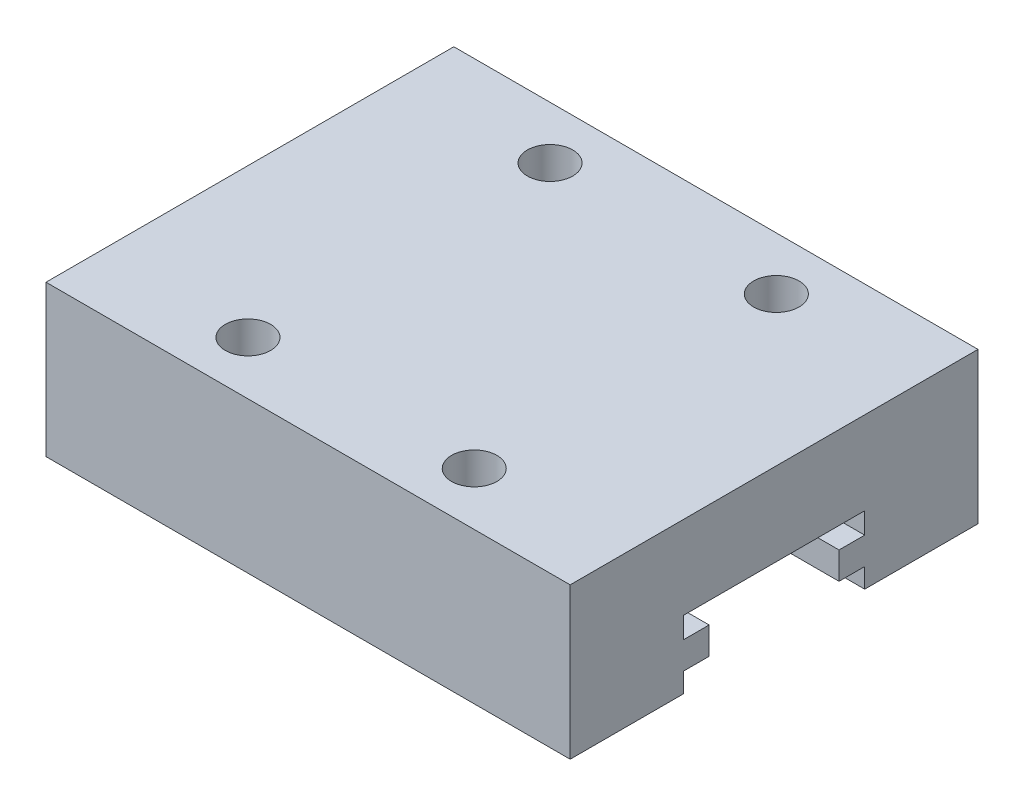
ISO-10303-21;
HEADER;
FILE_DESCRIPTION(('STEP AP214'),'2;1');
FILE_NAME('part.step','',(''),(''),'','','');
FILE_SCHEMA(('AUTOMOTIVE_DESIGN { 1 0 10303 214 1 1 1 1 }'));
ENDSEC;
DATA;
#1=APPLICATION_CONTEXT('core data for automotive mechanical design processes');
#2=APPLICATION_PROTOCOL_DEFINITION('international standard','automotive_design',2000,#1);
#3=PRODUCT_CONTEXT('',#1,'mechanical');
#4=PRODUCT('Part','Part','',(#3));
#5=PRODUCT_RELATED_PRODUCT_CATEGORY('part','',(#4));
#6=PRODUCT_DEFINITION_FORMATION('','',#4);
#7=PRODUCT_DEFINITION_CONTEXT('part definition',#1,'design');
#8=PRODUCT_DEFINITION('design','',#6,#7);
#9=PRODUCT_DEFINITION_SHAPE('','',#8);
#10=(LENGTH_UNIT() NAMED_UNIT(*) SI_UNIT(.MILLI.,.METRE.));
#11=(NAMED_UNIT(*) PLANE_ANGLE_UNIT() SI_UNIT($,.RADIAN.));
#12=(NAMED_UNIT(*) SI_UNIT($,.STERADIAN.) SOLID_ANGLE_UNIT());
#13=UNCERTAINTY_MEASURE_WITH_UNIT(LENGTH_MEASURE(1.E-05),#10,'distance_accuracy_value','');
#14=(GEOMETRIC_REPRESENTATION_CONTEXT(3) GLOBAL_UNCERTAINTY_ASSIGNED_CONTEXT((#13)) GLOBAL_UNIT_ASSIGNED_CONTEXT((#10,
#11,#12)) REPRESENTATION_CONTEXT('',''));
#15=CARTESIAN_POINT('',(0.,0.,0.));
#16=DIRECTION('',(0.,0.,1.));
#17=DIRECTION('',(1.,0.,0.));
#18=AXIS2_PLACEMENT_3D('',#15,#16,#17);
#19=CARTESIAN_POINT('',(0.,0.,0.));
#20=DIRECTION('',(0.,-1.,0.));
#21=DIRECTION('',(0.,0.,-1.));
#22=AXIS2_PLACEMENT_3D('',#19,#20,#21);
#23=PLANE('',#22);
#24=DIRECTION('',(1.,0.,0.));
#25=VECTOR('',#24,1.);
#26=CARTESIAN_POINT('',(-12.8160056179763,0.,-7.5));
#27=LINE('',#26,#25);
#28=CARTESIAN_POINT('',(0.,0.,-7.5));
#29=VERTEX_POINT('',#28);
#30=CARTESIAN_POINT('',(34.7,0.,-7.5));
#31=VERTEX_POINT('',#30);
#32=EDGE_CURVE('E198',#29,#31,#27,.T.);
#33=ORIENTED_EDGE('',*,*,#32,.T.);
#34=DIRECTION('',(0.,0.,-1.));
#35=VECTOR('',#34,1.);
#36=CARTESIAN_POINT('',(34.7,0.,0.));
#37=LINE('',#36,#35);
#38=CARTESIAN_POINT('',(34.7,0.,0.));
#39=VERTEX_POINT('',#38);
#40=EDGE_CURVE('E213',#39,#31,#37,.T.);
#41=ORIENTED_EDGE('',*,*,#40,.F.);
#42=DIRECTION('',(1.,0.,0.));
#43=VECTOR('',#42,1.);
#44=CARTESIAN_POINT('',(0.,0.,0.));
#45=LINE('',#44,#43);
#46=CARTESIAN_POINT('',(0.,0.,0.));
#47=VERTEX_POINT('',#46);
#48=EDGE_CURVE('E231',#47,#39,#45,.T.);
#49=ORIENTED_EDGE('',*,*,#48,.F.);
#50=DIRECTION('',(0.,0.,1.));
#51=VECTOR('',#50,1.);
#52=CARTESIAN_POINT('',(0.,0.,0.));
#53=LINE('',#52,#51);
#54=EDGE_CURVE('E214',#29,#47,#53,.T.);
#55=ORIENTED_EDGE('',*,*,#54,.F.);
#56=EDGE_LOOP('',(#33,#41,#49,#55));
#57=FACE_BOUND('',#56,.T.);
#58=ADVANCED_FACE('F40',(#57),#23,.T.);
#59=CARTESIAN_POINT('',(0.,10.,0.));
#60=DIRECTION('',(1.,0.,0.));
#61=DIRECTION('',(0.,0.,-1.));
#62=AXIS2_PLACEMENT_3D('',#59,#60,#61);
#63=PLANE('',#62);
#64=DIRECTION('',(0.,0.,-1.));
#65=VECTOR('',#64,1.);
#66=CARTESIAN_POINT('',(0.,1.3,-7.5));
#67=LINE('',#66,#65);
#68=CARTESIAN_POINT('',(0.,1.3,-7.5));
#69=VERTEX_POINT('',#68);
#70=CARTESIAN_POINT('',(0.,1.3,-9.2));
#71=VERTEX_POINT('',#70);
#72=EDGE_CURVE('E361',#69,#71,#67,.T.);
#73=ORIENTED_EDGE('',*,*,#72,.F.);
#74=DIRECTION('',(0.,1.,0.));
#75=VECTOR('',#74,1.);
#76=CARTESIAN_POINT('',(0.,0.,-7.5));
#77=LINE('',#76,#75);
#78=EDGE_CURVE('E293',#29,#69,#77,.T.);
#79=ORIENTED_EDGE('',*,*,#78,.F.);
#80=ORIENTED_EDGE('',*,*,#54,.T.);
#81=DIRECTION('',(0.,-1.,0.));
#82=VECTOR('',#81,1.);
#83=CARTESIAN_POINT('',(0.,10.,0.));
#84=LINE('',#83,#82);
#85=CARTESIAN_POINT('',(0.,10.,0.));
#86=VERTEX_POINT('',#85);
#87=EDGE_CURVE('E11',#86,#47,#84,.T.);
#88=ORIENTED_EDGE('',*,*,#87,.F.);
#89=DIRECTION('',(0.,0.,1.));
#90=VECTOR('',#89,1.);
#91=CARTESIAN_POINT('',(0.,10.,0.));
#92=LINE('',#91,#90);
#93=CARTESIAN_POINT('',(0.,10.,-27.));
#94=VERTEX_POINT('',#93);
#95=EDGE_CURVE('E228',#94,#86,#92,.T.);
#96=ORIENTED_EDGE('',*,*,#95,.F.);
#97=DIRECTION('',(0.,-1.,0.));
#98=VECTOR('',#97,1.);
#99=CARTESIAN_POINT('',(0.,10.,-27.));
#100=LINE('',#99,#98);
#101=CARTESIAN_POINT('',(0.,0.,-27.));
#102=VERTEX_POINT('',#101);
#103=EDGE_CURVE('E235',#94,#102,#100,.T.);
#104=ORIENTED_EDGE('',*,*,#103,.T.);
#105=CARTESIAN_POINT('',(0.,0.,-19.5));
#106=VERTEX_POINT('',#105);
#107=EDGE_CURVE('E258',#102,#106,#53,.T.);
#108=ORIENTED_EDGE('',*,*,#107,.T.);
#109=DIRECTION('',(0.,-1.,0.));
#110=VECTOR('',#109,1.);
#111=CARTESIAN_POINT('',(0.,0.,-19.5));
#112=LINE('',#111,#110);
#113=CARTESIAN_POINT('',(0.,1.3,-19.5));
#114=VERTEX_POINT('',#113);
#115=EDGE_CURVE('E59',#114,#106,#112,.T.);
#116=ORIENTED_EDGE('',*,*,#115,.F.);
#117=DIRECTION('',(0.,0.,-1.));
#118=VECTOR('',#117,1.);
#119=CARTESIAN_POINT('',(0.,1.3,-19.5));
#120=LINE('',#119,#118);
#121=CARTESIAN_POINT('',(0.,1.3,-17.8));
#122=VERTEX_POINT('',#121);
#123=EDGE_CURVE('E384',#122,#114,#120,.T.);
#124=ORIENTED_EDGE('',*,*,#123,.F.);
#125=DIRECTION('',(0.,-1.,0.));
#126=VECTOR('',#125,1.);
#127=CARTESIAN_POINT('',(0.,3.1,-17.8));
#128=LINE('',#127,#126);
#129=CARTESIAN_POINT('',(0.,3.1,-17.8));
#130=VERTEX_POINT('',#129);
#131=EDGE_CURVE('E381',#130,#122,#128,.T.);
#132=ORIENTED_EDGE('',*,*,#131,.F.);
#133=DIRECTION('',(0.,0.,1.));
#134=VECTOR('',#133,1.);
#135=CARTESIAN_POINT('',(0.,3.1,-19.5));
#136=LINE('',#135,#134);
#137=CARTESIAN_POINT('',(0.,3.1,-19.5));
#138=VERTEX_POINT('',#137);
#139=EDGE_CURVE('E378',#138,#130,#136,.T.);
#140=ORIENTED_EDGE('',*,*,#139,.F.);
#141=DIRECTION('',(0.,-1.,0.));
#142=VECTOR('',#141,1.);
#143=CARTESIAN_POINT('',(0.,3.1,-19.5));
#144=LINE('',#143,#142);
#145=CARTESIAN_POINT('',(0.,4.5,-19.5));
#146=VERTEX_POINT('',#145);
#147=EDGE_CURVE('E375',#146,#138,#144,.T.);
#148=ORIENTED_EDGE('',*,*,#147,.F.);
#149=DIRECTION('',(0.,0.,-1.));
#150=VECTOR('',#149,1.);
#151=CARTESIAN_POINT('',(0.,4.5,-7.5));
#152=LINE('',#151,#150);
#153=CARTESIAN_POINT('',(0.,4.5,-7.5));
#154=VERTEX_POINT('',#153);
#155=EDGE_CURVE('E373',#154,#146,#152,.T.);
#156=ORIENTED_EDGE('',*,*,#155,.F.);
#157=DIRECTION('',(0.,1.,0.));
#158=VECTOR('',#157,1.);
#159=CARTESIAN_POINT('',(0.,3.1,-7.5));
#160=LINE('',#159,#158);
#161=CARTESIAN_POINT('',(0.,3.1,-7.5));
#162=VERTEX_POINT('',#161);
#163=EDGE_CURVE('E370',#162,#154,#160,.T.);
#164=ORIENTED_EDGE('',*,*,#163,.F.);
#165=DIRECTION('',(0.,0.,1.));
#166=VECTOR('',#165,1.);
#167=CARTESIAN_POINT('',(0.,3.1,-7.5));
#168=LINE('',#167,#166);
#169=CARTESIAN_POINT('',(0.,3.1,-9.2));
#170=VERTEX_POINT('',#169);
#171=EDGE_CURVE('E367',#170,#162,#168,.T.);
#172=ORIENTED_EDGE('',*,*,#171,.F.);
#173=DIRECTION('',(0.,1.,0.));
#174=VECTOR('',#173,1.);
#175=CARTESIAN_POINT('',(0.,3.1,-9.2));
#176=LINE('',#175,#174);
#177=EDGE_CURVE('E364',#71,#170,#176,.T.);
#178=ORIENTED_EDGE('',*,*,#177,.F.);
#179=EDGE_LOOP('',(#73,#79,#80,#88,#96,#104,#108,#116,#124,#132,#140,#148,#156,#164,#172,#178));
#180=FACE_BOUND('',#179,.T.);
#181=ADVANCED_FACE('F42',(#180),#63,.F.);
#182=CARTESIAN_POINT('',(0.,10.,0.));
#183=DIRECTION('',(0.,0.,-1.));
#184=DIRECTION('',(-1.,0.,0.));
#185=AXIS2_PLACEMENT_3D('',#182,#183,#184);
#186=PLANE('',#185);
#187=ORIENTED_EDGE('',*,*,#48,.T.);
#188=DIRECTION('',(0.,-1.,0.));
#189=VECTOR('',#188,1.);
#190=CARTESIAN_POINT('',(34.7,10.,0.));
#191=LINE('',#190,#189);
#192=CARTESIAN_POINT('',(34.7,10.,0.));
#193=VERTEX_POINT('',#192);
#194=EDGE_CURVE('E49',#193,#39,#191,.T.);
#195=ORIENTED_EDGE('',*,*,#194,.F.);
#196=DIRECTION('',(1.,0.,0.));
#197=VECTOR('',#196,1.);
#198=CARTESIAN_POINT('',(0.,10.,0.));
#199=LINE('',#198,#197);
#200=EDGE_CURVE('E105',#86,#193,#199,.T.);
#201=ORIENTED_EDGE('',*,*,#200,.F.);
#202=ORIENTED_EDGE('',*,*,#87,.T.);
#203=EDGE_LOOP('',(#187,#195,#201,#202));
#204=FACE_BOUND('',#203,.T.);
#205=ADVANCED_FACE('F398',(#204),#186,.F.);
#206=CARTESIAN_POINT('',(34.7,10.,0.));
#207=DIRECTION('',(-1.,0.,0.));
#208=DIRECTION('',(0.,0.,1.));
#209=AXIS2_PLACEMENT_3D('',#206,#207,#208);
#210=PLANE('',#209);
#211=ORIENTED_EDGE('',*,*,#40,.T.);
#212=DIRECTION('',(0.,-1.,0.));
#213=VECTOR('',#212,1.);
#214=CARTESIAN_POINT('',(34.7,0.,-7.5));
#215=LINE('',#214,#213);
#216=CARTESIAN_POINT('',(34.7,1.3,-7.5));
#217=VERTEX_POINT('',#216);
#218=EDGE_CURVE('E195',#217,#31,#215,.T.);
#219=ORIENTED_EDGE('',*,*,#218,.F.);
#220=DIRECTION('',(0.,0.,1.));
#221=VECTOR('',#220,1.);
#222=CARTESIAN_POINT('',(34.7,1.3,-7.5));
#223=LINE('',#222,#221);
#224=CARTESIAN_POINT('',(34.7,1.3,-9.2));
#225=VERTEX_POINT('',#224);
#226=EDGE_CURVE('E217',#225,#217,#223,.T.);
#227=ORIENTED_EDGE('',*,*,#226,.F.);
#228=DIRECTION('',(0.,-1.,0.));
#229=VECTOR('',#228,1.);
#230=CARTESIAN_POINT('',(34.7,3.1,-9.2));
#231=LINE('',#230,#229);
#232=CARTESIAN_POINT('',(34.7,3.1,-9.2));
#233=VERTEX_POINT('',#232);
#234=EDGE_CURVE('E245',#233,#225,#231,.T.);
#235=ORIENTED_EDGE('',*,*,#234,.F.);
#236=DIRECTION('',(0.,0.,-1.));
#237=VECTOR('',#236,1.);
#238=CARTESIAN_POINT('',(34.7,3.1,-7.5));
#239=LINE('',#238,#237);
#240=CARTESIAN_POINT('',(34.7,3.1,-7.5));
#241=VERTEX_POINT('',#240);
#242=EDGE_CURVE('E328',#241,#233,#239,.T.);
#243=ORIENTED_EDGE('',*,*,#242,.F.);
#244=DIRECTION('',(0.,-1.,0.));
#245=VECTOR('',#244,1.);
#246=CARTESIAN_POINT('',(34.7,3.1,-7.5));
#247=LINE('',#246,#245);
#248=CARTESIAN_POINT('',(34.7,4.5,-7.5));
#249=VERTEX_POINT('',#248);
#250=EDGE_CURVE('E332',#249,#241,#247,.T.);
#251=ORIENTED_EDGE('',*,*,#250,.F.);
#252=DIRECTION('',(0.,0.,1.));
#253=VECTOR('',#252,1.);
#254=CARTESIAN_POINT('',(34.7,4.5,-7.5));
#255=LINE('',#254,#253);
#256=CARTESIAN_POINT('',(34.7,4.5,-19.5));
#257=VERTEX_POINT('',#256);
#258=EDGE_CURVE('E336',#257,#249,#255,.T.);
#259=ORIENTED_EDGE('',*,*,#258,.F.);
#260=DIRECTION('',(0.,1.,0.));
#261=VECTOR('',#260,1.);
#262=CARTESIAN_POINT('',(34.7,3.1,-19.5));
#263=LINE('',#262,#261);
#264=CARTESIAN_POINT('',(34.7,3.1,-19.5));
#265=VERTEX_POINT('',#264);
#266=EDGE_CURVE('E340',#265,#257,#263,.T.);
#267=ORIENTED_EDGE('',*,*,#266,.F.);
#268=DIRECTION('',(0.,0.,-1.));
#269=VECTOR('',#268,1.);
#270=CARTESIAN_POINT('',(34.7,3.1,-19.5));
#271=LINE('',#270,#269);
#272=CARTESIAN_POINT('',(34.7,3.1,-17.8));
#273=VERTEX_POINT('',#272);
#274=EDGE_CURVE('E344',#273,#265,#271,.T.);
#275=ORIENTED_EDGE('',*,*,#274,.F.);
#276=DIRECTION('',(0.,1.,0.));
#277=VECTOR('',#276,1.);
#278=CARTESIAN_POINT('',(34.7,3.1,-17.8));
#279=LINE('',#278,#277);
#280=CARTESIAN_POINT('',(34.7,1.3,-17.8));
#281=VERTEX_POINT('',#280);
#282=EDGE_CURVE('E348',#281,#273,#279,.T.);
#283=ORIENTED_EDGE('',*,*,#282,.F.);
#284=DIRECTION('',(0.,0.,1.));
#285=VECTOR('',#284,1.);
#286=CARTESIAN_POINT('',(34.7,1.3,-19.5));
#287=LINE('',#286,#285);
#288=CARTESIAN_POINT('',(34.7,1.3,-19.5));
#289=VERTEX_POINT('',#288);
#290=EDGE_CURVE('E352',#289,#281,#287,.T.);
#291=ORIENTED_EDGE('',*,*,#290,.F.);
#292=DIRECTION('',(0.,1.,0.));
#293=VECTOR('',#292,1.);
#294=CARTESIAN_POINT('',(34.7,0.,-19.5));
#295=LINE('',#294,#293);
#296=CARTESIAN_POINT('',(34.7,0.,-19.5));
#297=VERTEX_POINT('',#296);
#298=EDGE_CURVE('E207',#297,#289,#295,.T.);
#299=ORIENTED_EDGE('',*,*,#298,.F.);
#300=CARTESIAN_POINT('',(34.7,0.,-27.));
#301=VERTEX_POINT('',#300);
#302=EDGE_CURVE('E223',#297,#301,#37,.T.);
#303=ORIENTED_EDGE('',*,*,#302,.T.);
#304=DIRECTION('',(0.,-1.,0.));
#305=VECTOR('',#304,1.);
#306=CARTESIAN_POINT('',(34.7,10.,-27.));
#307=LINE('',#306,#305);
#308=CARTESIAN_POINT('',(34.7,10.,-27.));
#309=VERTEX_POINT('',#308);
#310=EDGE_CURVE('E238',#309,#301,#307,.T.);
#311=ORIENTED_EDGE('',*,*,#310,.F.);
#312=DIRECTION('',(0.,0.,-1.));
#313=VECTOR('',#312,1.);
#314=CARTESIAN_POINT('',(34.7,10.,0.));
#315=LINE('',#314,#313);
#316=EDGE_CURVE('E243',#193,#309,#315,.T.);
#317=ORIENTED_EDGE('',*,*,#316,.F.);
#318=ORIENTED_EDGE('',*,*,#194,.T.);
#319=EDGE_LOOP('',(#211,#219,#227,#235,#243,#251,#259,#267,#275,#283,#291,#299,#303,#311,#317,#318));
#320=FACE_BOUND('',#319,.T.);
#321=ADVANCED_FACE('F220',(#320),#210,.F.);
#322=CARTESIAN_POINT('',(0.,10.,-27.));
#323=DIRECTION('',(0.,0.,1.));
#324=DIRECTION('',(1.,0.,0.));
#325=AXIS2_PLACEMENT_3D('',#322,#323,#324);
#326=PLANE('',#325);
#327=DIRECTION('',(-1.,0.,0.));
#328=VECTOR('',#327,1.);
#329=CARTESIAN_POINT('',(0.,0.,-27.));
#330=LINE('',#329,#328);
#331=EDGE_CURVE('E95',#301,#102,#330,.T.);
#332=ORIENTED_EDGE('',*,*,#331,.T.);
#333=ORIENTED_EDGE('',*,*,#103,.F.);
#334=DIRECTION('',(-1.,0.,0.));
#335=VECTOR('',#334,1.);
#336=CARTESIAN_POINT('',(0.,10.,-27.));
#337=LINE('',#336,#335);
#338=EDGE_CURVE('E71',#309,#94,#337,.T.);
#339=ORIENTED_EDGE('',*,*,#338,.F.);
#340=ORIENTED_EDGE('',*,*,#310,.T.);
#341=EDGE_LOOP('',(#332,#333,#339,#340));
#342=FACE_BOUND('',#341,.T.);
#343=ADVANCED_FACE('F420',(#342),#326,.F.);
#344=CARTESIAN_POINT('',(0.,10.,0.));
#345=DIRECTION('',(0.,-1.,0.));
#346=DIRECTION('',(0.,0.,-1.));
#347=AXIS2_PLACEMENT_3D('',#344,#345,#346);
#348=PLANE('',#347);
#349=CARTESIAN_POINT('',(24.8499864669187,10.,-23.5));
#350=DIRECTION('',(0.,1.,0.));
#351=DIRECTION('',(0.,0.,1.));
#352=AXIS2_PLACEMENT_3D('',#349,#350,#351);
#353=CIRCLE('',#352,1.5);
#354=CARTESIAN_POINT('',(24.8499864669187,10.,-22.));
#355=VERTEX_POINT('',#354);
#356=EDGE_CURVE('E250',#355,#355,#353,.T.);
#357=ORIENTED_EDGE('',*,*,#356,.F.);
#358=EDGE_LOOP('',(#357));
#359=FACE_BOUND('',#358,.T.);
#360=CARTESIAN_POINT('',(9.85,10.,-3.52014924954561));
#361=DIRECTION('',(0.,1.,0.));
#362=DIRECTION('',(0.,0.,1.));
#363=AXIS2_PLACEMENT_3D('',#360,#361,#362);
#364=CIRCLE('',#363,1.5);
#365=CARTESIAN_POINT('',(9.85,10.,-2.02014924954561));
#366=VERTEX_POINT('',#365);
#367=EDGE_CURVE('E251',#366,#366,#364,.T.);
#368=ORIENTED_EDGE('',*,*,#367,.F.);
#369=EDGE_LOOP('',(#368));
#370=FACE_BOUND('',#369,.T.);
#371=CARTESIAN_POINT('',(24.8499864669187,10.,-3.5));
#372=DIRECTION('',(0.,1.,0.));
#373=DIRECTION('',(0.,0.,1.));
#374=AXIS2_PLACEMENT_3D('',#371,#372,#373);
#375=CIRCLE('',#374,1.5);
#376=CARTESIAN_POINT('',(24.8499864669187,10.,-2.));
#377=VERTEX_POINT('',#376);
#378=EDGE_CURVE('E256',#377,#377,#375,.T.);
#379=ORIENTED_EDGE('',*,*,#378,.F.);
#380=EDGE_LOOP('',(#379));
#381=FACE_BOUND('',#380,.T.);
#382=CARTESIAN_POINT('',(9.85,10.,-23.5201492495456));
#383=DIRECTION('',(0.,1.,0.));
#384=DIRECTION('',(0.,0.,1.));
#385=AXIS2_PLACEMENT_3D('',#382,#383,#384);
#386=CIRCLE('',#385,1.5);
#387=CARTESIAN_POINT('',(9.85,10.,-22.0201492495456));
#388=VERTEX_POINT('',#387);
#389=EDGE_CURVE('E274',#388,#388,#386,.T.);
#390=ORIENTED_EDGE('',*,*,#389,.F.);
#391=EDGE_LOOP('',(#390));
#392=FACE_BOUND('',#391,.T.);
#393=ORIENTED_EDGE('',*,*,#95,.T.);
#394=ORIENTED_EDGE('',*,*,#200,.T.);
#395=ORIENTED_EDGE('',*,*,#316,.T.);
#396=ORIENTED_EDGE('',*,*,#338,.T.);
#397=EDGE_LOOP('',(#393,#394,#395,#396));
#398=FACE_BOUND('',#397,.T.);
#399=ADVANCED_FACE('F411',(#359,#370,#381,#392,#398),#348,.F.);
#400=DIRECTION('',(1.,0.,0.));
#401=VECTOR('',#400,1.);
#402=CARTESIAN_POINT('',(-12.8160056179763,0.,-19.5));
#403=LINE('',#402,#401);
#404=EDGE_CURVE('E216',#106,#297,#403,.T.);
#405=ORIENTED_EDGE('',*,*,#404,.F.);
#406=ORIENTED_EDGE('',*,*,#107,.F.);
#407=ORIENTED_EDGE('',*,*,#331,.F.);
#408=ORIENTED_EDGE('',*,*,#302,.F.);
#409=EDGE_LOOP('',(#405,#406,#407,#408));
#410=FACE_BOUND('',#409,.T.);
#411=ADVANCED_FACE('F404',(#410),#23,.T.);
#412=CARTESIAN_POINT('',(9.85,5.,-23.5201492495456));
#413=DIRECTION('',(0.,1.,0.));
#414=DIRECTION('',(0.,0.,1.));
#415=AXIS2_PLACEMENT_3D('',#412,#413,#414);
#416=CYLINDRICAL_SURFACE('',#415,1.5);
#417=CARTESIAN_POINT('',(9.85,5.,-23.5201492495456));
#418=DIRECTION('',(0.,1.,0.));
#419=DIRECTION('',(0.,0.,1.));
#420=AXIS2_PLACEMENT_3D('',#417,#418,#419);
#421=CIRCLE('',#420,1.5);
#422=CARTESIAN_POINT('',(9.85,5.,-22.0201492495456));
#423=VERTEX_POINT('',#422);
#424=EDGE_CURVE('E265',#423,#423,#421,.T.);
#425=ORIENTED_EDGE('',*,*,#424,.F.);
#426=EDGE_LOOP('',(#425));
#427=FACE_BOUND('',#426,.T.);
#428=ORIENTED_EDGE('',*,*,#389,.T.);
#429=EDGE_LOOP('',(#428));
#430=FACE_BOUND('',#429,.T.);
#431=ADVANCED_FACE('F410',(#427,#430),#416,.F.);
#432=CARTESIAN_POINT('',(9.85,5.,-23.5201492495456));
#433=DIRECTION('',(0.,1.,0.));
#434=DIRECTION('',(0.,0.,1.));
#435=AXIS2_PLACEMENT_3D('',#432,#433,#434);
#436=PLANE('',#435);
#437=ORIENTED_EDGE('',*,*,#424,.T.);
#438=EDGE_LOOP('',(#437));
#439=FACE_BOUND('',#438,.T.);
#440=ADVANCED_FACE('F417',(#439),#436,.T.);
#441=CARTESIAN_POINT('',(24.8499864669187,5.,-3.5));
#442=DIRECTION('',(0.,1.,0.));
#443=DIRECTION('',(0.,0.,1.));
#444=AXIS2_PLACEMENT_3D('',#441,#442,#443);
#445=CYLINDRICAL_SURFACE('',#444,1.5);
#446=CARTESIAN_POINT('',(24.8499864669187,5.,-3.5));
#447=DIRECTION('',(0.,1.,0.));
#448=DIRECTION('',(0.,0.,1.));
#449=AXIS2_PLACEMENT_3D('',#446,#447,#448);
#450=CIRCLE('',#449,1.5);
#451=CARTESIAN_POINT('',(24.8499864669187,5.,-2.));
#452=VERTEX_POINT('',#451);
#453=EDGE_CURVE('E254',#452,#452,#450,.T.);
#454=ORIENTED_EDGE('',*,*,#453,.F.);
#455=EDGE_LOOP('',(#454));
#456=FACE_BOUND('',#455,.T.);
#457=ORIENTED_EDGE('',*,*,#378,.T.);
#458=EDGE_LOOP('',(#457));
#459=FACE_BOUND('',#458,.T.);
#460=ADVANCED_FACE('F489',(#456,#459),#445,.F.);
#461=CARTESIAN_POINT('',(24.8499864669187,5.,-3.5));
#462=DIRECTION('',(0.,1.,0.));
#463=DIRECTION('',(0.,0.,1.));
#464=AXIS2_PLACEMENT_3D('',#461,#462,#463);
#465=PLANE('',#464);
#466=ORIENTED_EDGE('',*,*,#453,.T.);
#467=EDGE_LOOP('',(#466));
#468=FACE_BOUND('',#467,.T.);
#469=ADVANCED_FACE('F485',(#468),#465,.T.);
#470=CARTESIAN_POINT('',(9.85,5.,-3.52014924954561));
#471=DIRECTION('',(0.,1.,0.));
#472=DIRECTION('',(0.,0.,1.));
#473=AXIS2_PLACEMENT_3D('',#470,#471,#472);
#474=CYLINDRICAL_SURFACE('',#473,1.5);
#475=CARTESIAN_POINT('',(9.85,5.,-3.52014924954561));
#476=DIRECTION('',(0.,1.,0.));
#477=DIRECTION('',(0.,0.,1.));
#478=AXIS2_PLACEMENT_3D('',#475,#476,#477);
#479=CIRCLE('',#478,1.5);
#480=CARTESIAN_POINT('',(9.85,5.,-2.02014924954561));
#481=VERTEX_POINT('',#480);
#482=EDGE_CURVE('E248',#481,#481,#479,.T.);
#483=ORIENTED_EDGE('',*,*,#482,.F.);
#484=EDGE_LOOP('',(#483));
#485=FACE_BOUND('',#484,.T.);
#486=ORIENTED_EDGE('',*,*,#367,.T.);
#487=EDGE_LOOP('',(#486));
#488=FACE_BOUND('',#487,.T.);
#489=ADVANCED_FACE('F488',(#485,#488),#474,.F.);
#490=CARTESIAN_POINT('',(9.85,5.,-3.52014924954561));
#491=DIRECTION('',(0.,1.,0.));
#492=DIRECTION('',(0.,0.,1.));
#493=AXIS2_PLACEMENT_3D('',#490,#491,#492);
#494=PLANE('',#493);
#495=ORIENTED_EDGE('',*,*,#482,.T.);
#496=EDGE_LOOP('',(#495));
#497=FACE_BOUND('',#496,.T.);
#498=ADVANCED_FACE('F500',(#497),#494,.T.);
#499=CARTESIAN_POINT('',(24.8499864669187,5.,-23.5));
#500=DIRECTION('',(0.,1.,0.));
#501=DIRECTION('',(0.,0.,1.));
#502=AXIS2_PLACEMENT_3D('',#499,#500,#501);
#503=CYLINDRICAL_SURFACE('',#502,1.5);
#504=CARTESIAN_POINT('',(24.8499864669187,5.,-23.5));
#505=DIRECTION('',(0.,1.,0.));
#506=DIRECTION('',(0.,0.,1.));
#507=AXIS2_PLACEMENT_3D('',#504,#505,#506);
#508=CIRCLE('',#507,1.5);
#509=CARTESIAN_POINT('',(24.8499864669187,5.,-22.));
#510=VERTEX_POINT('',#509);
#511=EDGE_CURVE('E278',#510,#510,#508,.T.);
#512=ORIENTED_EDGE('',*,*,#511,.F.);
#513=EDGE_LOOP('',(#512));
#514=FACE_BOUND('',#513,.T.);
#515=ORIENTED_EDGE('',*,*,#356,.T.);
#516=EDGE_LOOP('',(#515));
#517=FACE_BOUND('',#516,.T.);
#518=ADVANCED_FACE('F496',(#514,#517),#503,.F.);
#519=CARTESIAN_POINT('',(24.8499864669187,5.,-23.5));
#520=DIRECTION('',(0.,1.,0.));
#521=DIRECTION('',(0.,0.,1.));
#522=AXIS2_PLACEMENT_3D('',#519,#520,#521);
#523=PLANE('',#522);
#524=ORIENTED_EDGE('',*,*,#511,.T.);
#525=EDGE_LOOP('',(#524));
#526=FACE_BOUND('',#525,.T.);
#527=ADVANCED_FACE('F466',(#526),#523,.T.);
#528=CARTESIAN_POINT('',(-12.8160056179763,0.,-7.5));
#529=DIRECTION('',(0.,0.,1.));
#530=DIRECTION('',(0.,-1.,0.));
#531=AXIS2_PLACEMENT_3D('',#528,#529,#530);
#532=PLANE('',#531);
#533=ORIENTED_EDGE('',*,*,#78,.T.);
#534=DIRECTION('',(1.,0.,0.));
#535=VECTOR('',#534,1.);
#536=CARTESIAN_POINT('',(-12.8160056179763,1.3,-7.5));
#537=LINE('',#536,#535);
#538=EDGE_CURVE('E201',#69,#217,#537,.T.);
#539=ORIENTED_EDGE('',*,*,#538,.T.);
#540=ORIENTED_EDGE('',*,*,#218,.T.);
#541=ORIENTED_EDGE('',*,*,#32,.F.);
#542=EDGE_LOOP('',(#533,#539,#540,#541));
#543=FACE_BOUND('',#542,.T.);
#544=ADVANCED_FACE('F197',(#543),#532,.F.);
#545=CARTESIAN_POINT('',(-12.8160056179763,1.3,-7.5));
#546=DIRECTION('',(0.,1.,0.));
#547=DIRECTION('',(0.,0.,1.));
#548=AXIS2_PLACEMENT_3D('',#545,#546,#547);
#549=PLANE('',#548);
#550=ORIENTED_EDGE('',*,*,#72,.T.);
#551=DIRECTION('',(1.,0.,0.));
#552=VECTOR('',#551,1.);
#553=CARTESIAN_POINT('',(-12.8160056179763,1.3,-9.2));
#554=LINE('',#553,#552);
#555=EDGE_CURVE('E321',#71,#225,#554,.T.);
#556=ORIENTED_EDGE('',*,*,#555,.T.);
#557=ORIENTED_EDGE('',*,*,#226,.T.);
#558=ORIENTED_EDGE('',*,*,#538,.F.);
#559=EDGE_LOOP('',(#550,#556,#557,#558));
#560=FACE_BOUND('',#559,.T.);
#561=ADVANCED_FACE('F458',(#560),#549,.F.);
#562=CARTESIAN_POINT('',(-12.8160056179763,3.1,-9.2));
#563=DIRECTION('',(0.,0.,1.));
#564=DIRECTION('',(0.,-1.,0.));
#565=AXIS2_PLACEMENT_3D('',#562,#563,#564);
#566=PLANE('',#565);
#567=ORIENTED_EDGE('',*,*,#177,.T.);
#568=DIRECTION('',(1.,0.,0.));
#569=VECTOR('',#568,1.);
#570=CARTESIAN_POINT('',(-12.8160056179763,3.1,-9.2));
#571=LINE('',#570,#569);
#572=EDGE_CURVE('E318',#170,#233,#571,.T.);
#573=ORIENTED_EDGE('',*,*,#572,.T.);
#574=ORIENTED_EDGE('',*,*,#234,.T.);
#575=ORIENTED_EDGE('',*,*,#555,.F.);
#576=EDGE_LOOP('',(#567,#573,#574,#575));
#577=FACE_BOUND('',#576,.T.);
#578=ADVANCED_FACE('F455',(#577),#566,.F.);
#579=CARTESIAN_POINT('',(-12.8160056179763,3.1,-7.5));
#580=DIRECTION('',(0.,-1.,0.));
#581=DIRECTION('',(0.,0.,-1.));
#582=AXIS2_PLACEMENT_3D('',#579,#580,#581);
#583=PLANE('',#582);
#584=ORIENTED_EDGE('',*,*,#171,.T.);
#585=DIRECTION('',(1.,0.,0.));
#586=VECTOR('',#585,1.);
#587=CARTESIAN_POINT('',(-12.8160056179763,3.1,-7.5));
#588=LINE('',#587,#586);
#589=EDGE_CURVE('E315',#162,#241,#588,.T.);
#590=ORIENTED_EDGE('',*,*,#589,.T.);
#591=ORIENTED_EDGE('',*,*,#242,.T.);
#592=ORIENTED_EDGE('',*,*,#572,.F.);
#593=EDGE_LOOP('',(#584,#590,#591,#592));
#594=FACE_BOUND('',#593,.T.);
#595=ADVANCED_FACE('F451',(#594),#583,.F.);
#596=CARTESIAN_POINT('',(-12.8160056179763,3.1,-7.5));
#597=DIRECTION('',(0.,0.,1.));
#598=DIRECTION('',(0.,-1.,0.));
#599=AXIS2_PLACEMENT_3D('',#596,#597,#598);
#600=PLANE('',#599);
#601=ORIENTED_EDGE('',*,*,#163,.T.);
#602=DIRECTION('',(1.,0.,0.));
#603=VECTOR('',#602,1.);
#604=CARTESIAN_POINT('',(-12.8160056179763,4.5,-7.5));
#605=LINE('',#604,#603);
#606=EDGE_CURVE('E312',#154,#249,#605,.T.);
#607=ORIENTED_EDGE('',*,*,#606,.T.);
#608=ORIENTED_EDGE('',*,*,#250,.T.);
#609=ORIENTED_EDGE('',*,*,#589,.F.);
#610=EDGE_LOOP('',(#601,#607,#608,#609));
#611=FACE_BOUND('',#610,.T.);
#612=ADVANCED_FACE('F448',(#611),#600,.F.);
#613=CARTESIAN_POINT('',(-12.8160056179763,4.5,-7.5));
#614=DIRECTION('',(0.,1.,0.));
#615=DIRECTION('',(0.,0.,1.));
#616=AXIS2_PLACEMENT_3D('',#613,#614,#615);
#617=PLANE('',#616);
#618=ORIENTED_EDGE('',*,*,#155,.T.);
#619=DIRECTION('',(1.,0.,0.));
#620=VECTOR('',#619,1.);
#621=CARTESIAN_POINT('',(-12.8160056179763,4.5,-19.5));
#622=LINE('',#621,#620);
#623=EDGE_CURVE('E309',#146,#257,#622,.T.);
#624=ORIENTED_EDGE('',*,*,#623,.T.);
#625=ORIENTED_EDGE('',*,*,#258,.T.);
#626=ORIENTED_EDGE('',*,*,#606,.F.);
#627=EDGE_LOOP('',(#618,#624,#625,#626));
#628=FACE_BOUND('',#627,.T.);
#629=ADVANCED_FACE('F441',(#628),#617,.F.);
#630=CARTESIAN_POINT('',(-12.8160056179763,3.1,-19.5));
#631=DIRECTION('',(0.,0.,-1.));
#632=DIRECTION('',(0.,1.,0.));
#633=AXIS2_PLACEMENT_3D('',#630,#631,#632);
#634=PLANE('',#633);
#635=ORIENTED_EDGE('',*,*,#147,.T.);
#636=DIRECTION('',(1.,0.,0.));
#637=VECTOR('',#636,1.);
#638=CARTESIAN_POINT('',(-12.8160056179763,3.1,-19.5));
#639=LINE('',#638,#637);
#640=EDGE_CURVE('E306',#138,#265,#639,.T.);
#641=ORIENTED_EDGE('',*,*,#640,.T.);
#642=ORIENTED_EDGE('',*,*,#266,.T.);
#643=ORIENTED_EDGE('',*,*,#623,.F.);
#644=EDGE_LOOP('',(#635,#641,#642,#643));
#645=FACE_BOUND('',#644,.T.);
#646=ADVANCED_FACE('F437',(#645),#634,.F.);
#647=CARTESIAN_POINT('',(-12.8160056179763,3.1,-19.5));
#648=DIRECTION('',(0.,-1.,0.));
#649=DIRECTION('',(0.,0.,-1.));
#650=AXIS2_PLACEMENT_3D('',#647,#648,#649);
#651=PLANE('',#650);
#652=ORIENTED_EDGE('',*,*,#139,.T.);
#653=DIRECTION('',(1.,0.,0.));
#654=VECTOR('',#653,1.);
#655=CARTESIAN_POINT('',(-12.8160056179763,3.1,-17.8));
#656=LINE('',#655,#654);
#657=EDGE_CURVE('E303',#130,#273,#656,.T.);
#658=ORIENTED_EDGE('',*,*,#657,.T.);
#659=ORIENTED_EDGE('',*,*,#274,.T.);
#660=ORIENTED_EDGE('',*,*,#640,.F.);
#661=EDGE_LOOP('',(#652,#658,#659,#660));
#662=FACE_BOUND('',#661,.T.);
#663=ADVANCED_FACE('F435',(#662),#651,.F.);
#664=CARTESIAN_POINT('',(-12.8160056179763,3.1,-17.8));
#665=DIRECTION('',(0.,0.,-1.));
#666=DIRECTION('',(0.,1.,0.));
#667=AXIS2_PLACEMENT_3D('',#664,#665,#666);
#668=PLANE('',#667);
#669=ORIENTED_EDGE('',*,*,#131,.T.);
#670=DIRECTION('',(1.,0.,0.));
#671=VECTOR('',#670,1.);
#672=CARTESIAN_POINT('',(-12.8160056179763,1.3,-17.8));
#673=LINE('',#672,#671);
#674=EDGE_CURVE('E300',#122,#281,#673,.T.);
#675=ORIENTED_EDGE('',*,*,#674,.T.);
#676=ORIENTED_EDGE('',*,*,#282,.T.);
#677=ORIENTED_EDGE('',*,*,#657,.F.);
#678=EDGE_LOOP('',(#669,#675,#676,#677));
#679=FACE_BOUND('',#678,.T.);
#680=ADVANCED_FACE('F429',(#679),#668,.F.);
#681=CARTESIAN_POINT('',(-12.8160056179763,1.3,-19.5));
#682=DIRECTION('',(0.,1.,0.));
#683=DIRECTION('',(0.,0.,1.));
#684=AXIS2_PLACEMENT_3D('',#681,#682,#683);
#685=PLANE('',#684);
#686=ORIENTED_EDGE('',*,*,#123,.T.);
#687=DIRECTION('',(1.,0.,0.));
#688=VECTOR('',#687,1.);
#689=CARTESIAN_POINT('',(-12.8160056179763,1.3,-19.5));
#690=LINE('',#689,#688);
#691=EDGE_CURVE('E297',#114,#289,#690,.T.);
#692=ORIENTED_EDGE('',*,*,#691,.T.);
#693=ORIENTED_EDGE('',*,*,#290,.T.);
#694=ORIENTED_EDGE('',*,*,#674,.F.);
#695=EDGE_LOOP('',(#686,#692,#693,#694));
#696=FACE_BOUND('',#695,.T.);
#697=ADVANCED_FACE('F390',(#696),#685,.F.);
#698=CARTESIAN_POINT('',(-12.8160056179763,0.,-19.5));
#699=DIRECTION('',(0.,0.,-1.));
#700=DIRECTION('',(0.,1.,0.));
#701=AXIS2_PLACEMENT_3D('',#698,#699,#700);
#702=PLANE('',#701);
#703=ORIENTED_EDGE('',*,*,#115,.T.);
#704=ORIENTED_EDGE('',*,*,#404,.T.);
#705=ORIENTED_EDGE('',*,*,#298,.T.);
#706=ORIENTED_EDGE('',*,*,#691,.F.);
#707=EDGE_LOOP('',(#703,#704,#705,#706));
#708=FACE_BOUND('',#707,.T.);
#709=ADVANCED_FACE('F392',(#708),#702,.F.);
#710=CLOSED_SHELL('',(#58,#181,#205,#321,#343,#399,#411,#431,#440,#460,#469,#489,#498,#518,#527,
#544,#561,#578,#595,#612,#629,#646,#663,#680,#697,#709));
#711=MANIFOLD_SOLID_BREP('B2',#710);
#712=ADVANCED_BREP_SHAPE_REPRESENTATION('',(#18,#711),#14);
#713=SHAPE_DEFINITION_REPRESENTATION(#9,#712);
ENDSEC;
END-ISO-10303-21;
